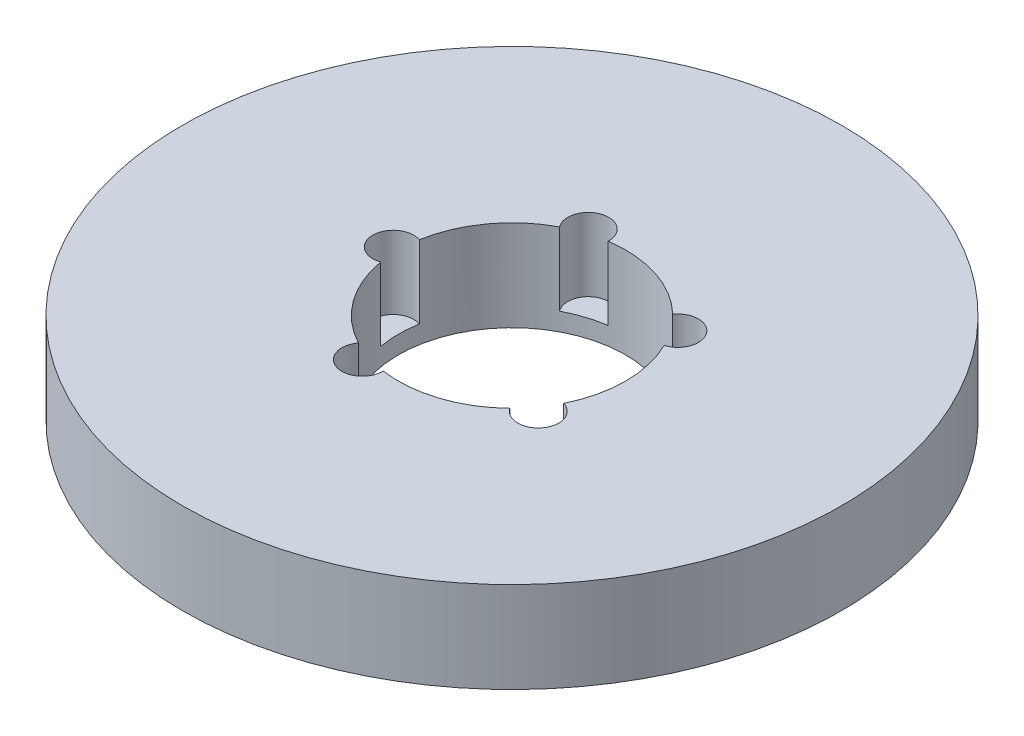
ISO-10303-21;
HEADER;
FILE_DESCRIPTION(('STEP AP214'),'2;1');
FILE_NAME('part.step','',(''),(''),'','','');
FILE_SCHEMA(('AUTOMOTIVE_DESIGN { 1 0 10303 214 1 1 1 1 }'));
ENDSEC;
DATA;
#1=APPLICATION_CONTEXT('core data for automotive mechanical design processes');
#2=APPLICATION_PROTOCOL_DEFINITION('international standard','automotive_design',2000,#1);
#3=PRODUCT_CONTEXT('',#1,'mechanical');
#4=PRODUCT('Part','Part','',(#3));
#5=PRODUCT_RELATED_PRODUCT_CATEGORY('part','',(#4));
#6=PRODUCT_DEFINITION_FORMATION('','',#4);
#7=PRODUCT_DEFINITION_CONTEXT('part definition',#1,'design');
#8=PRODUCT_DEFINITION('design','',#6,#7);
#9=PRODUCT_DEFINITION_SHAPE('','',#8);
#10=(LENGTH_UNIT() NAMED_UNIT(*) SI_UNIT(.MILLI.,.METRE.));
#11=(NAMED_UNIT(*) PLANE_ANGLE_UNIT() SI_UNIT($,.RADIAN.));
#12=(NAMED_UNIT(*) SI_UNIT($,.STERADIAN.) SOLID_ANGLE_UNIT());
#13=UNCERTAINTY_MEASURE_WITH_UNIT(LENGTH_MEASURE(1.E-05),#10,'distance_accuracy_value','');
#14=(GEOMETRIC_REPRESENTATION_CONTEXT(3) GLOBAL_UNCERTAINTY_ASSIGNED_CONTEXT((#13)) GLOBAL_UNIT_ASSIGNED_CONTEXT((#10,
#11,#12)) REPRESENTATION_CONTEXT('',''));
#15=CARTESIAN_POINT('',(0.,0.,0.));
#16=DIRECTION('',(0.,0.,1.));
#17=DIRECTION('',(1.,0.,0.));
#18=AXIS2_PLACEMENT_3D('',#15,#16,#17);
#19=CARTESIAN_POINT('',(0.,20.,0.));
#20=DIRECTION('',(0.,-1.,0.));
#21=DIRECTION('',(0.,0.,-1.));
#22=AXIS2_PLACEMENT_3D('',#19,#20,#21);
#23=CYLINDRICAL_SURFACE('',#22,72.5);
#24=CARTESIAN_POINT('',(0.,20.,0.));
#25=DIRECTION('',(0.,1.,0.));
#26=DIRECTION('',(0.,0.,1.));
#27=AXIS2_PLACEMENT_3D('',#24,#25,#26);
#28=CIRCLE('',#27,72.5);
#29=CARTESIAN_POINT('',(0.,20.,72.5));
#30=VERTEX_POINT('',#29);
#31=EDGE_CURVE('E160',#30,#30,#28,.T.);
#32=ORIENTED_EDGE('',*,*,#31,.F.);
#33=EDGE_LOOP('',(#32));
#34=FACE_BOUND('',#33,.T.);
#35=CARTESIAN_POINT('',(0.,0.,0.));
#36=DIRECTION('',(0.,1.,0.));
#37=DIRECTION('',(0.,0.,1.));
#38=AXIS2_PLACEMENT_3D('',#35,#36,#37);
#39=CIRCLE('',#38,72.5);
#40=CARTESIAN_POINT('',(0.,0.,72.5));
#41=VERTEX_POINT('',#40);
#42=EDGE_CURVE('E153',#41,#41,#39,.T.);
#43=ORIENTED_EDGE('',*,*,#42,.T.);
#44=EDGE_LOOP('',(#43));
#45=FACE_BOUND('',#44,.T.);
#46=ADVANCED_FACE('F39',(#34,#45),#23,.T.);
#47=CARTESIAN_POINT('',(0.,20.,0.));
#48=DIRECTION('',(0.,1.,0.));
#49=DIRECTION('',(0.,0.,1.));
#50=AXIS2_PLACEMENT_3D('',#47,#48,#49);
#51=PLANE('',#50);
#52=CARTESIAN_POINT('',(-8.07488520360902,20.,24.8519412557278));
#53=DIRECTION('',(0.,1.,0.));
#54=DIRECTION('',(0.951056516295155,0.,0.309016994374945));
#55=AXIS2_PLACEMENT_3D('',#52,#53,#54);
#56=CIRCLE('',#55,4.50272773655138);
#57=CARTESIAN_POINT('',(-11.6527432233736,20.,22.1181729663668));
#58=VERTEX_POINT('',#57);
#59=CARTESIAN_POINT('',(-3.5734685784876,20.,24.7432884297654));
#60=VERTEX_POINT('',#59);
#61=EDGE_CURVE('E186',#58,#60,#56,.T.);
#62=ORIENTED_EDGE('',*,*,#61,.F.);
#63=CARTESIAN_POINT('',(0.,20.,0.));
#64=DIRECTION('',(0.,1.,0.));
#65=DIRECTION('',(0.,0.,1.));
#66=AXIS2_PLACEMENT_3D('',#63,#64,#65);
#67=CIRCLE('',#66,25.);
#68=CARTESIAN_POINT('',(-24.6365282153164,20.,4.24752604417183));
#69=VERTEX_POINT('',#68);
#70=EDGE_CURVE('E148',#69,#58,#67,.T.);
#71=ORIENTED_EDGE('',*,*,#70,.F.);
#72=CARTESIAN_POINT('',(-26.1308774293862,20.,0.));
#73=DIRECTION('',(0.,1.,0.));
#74=DIRECTION('',(0.,0.,1.));
#75=AXIS2_PLACEMENT_3D('',#72,#73,#74);
#76=CIRCLE('',#75,4.50272773655138);
#77=CARTESIAN_POINT('',(-24.6365282153164,20.,-4.24752604417183));
#78=VERTEX_POINT('',#77);
#79=EDGE_CURVE('E142',#78,#69,#76,.T.);
#80=ORIENTED_EDGE('',*,*,#79,.F.);
#81=CARTESIAN_POINT('',(-11.6527432233739,20.,-22.1181729663667));
#82=VERTEX_POINT('',#81);
#83=EDGE_CURVE('E132',#82,#78,#67,.T.);
#84=ORIENTED_EDGE('',*,*,#83,.F.);
#85=CARTESIAN_POINT('',(-8.07488520360937,20.,-24.8519412557276));
#86=DIRECTION('',(0.,1.,0.));
#87=DIRECTION('',(-0.95105651629515,0.,0.309016994374958));
#88=AXIS2_PLACEMENT_3D('',#85,#86,#87);
#89=CIRCLE('',#88,4.50272773655138);
#90=CARTESIAN_POINT('',(-3.57346857848795,20.,-24.7432884297653));
#91=VERTEX_POINT('',#90);
#92=EDGE_CURVE('E111',#91,#82,#89,.T.);
#93=ORIENTED_EDGE('',*,*,#92,.F.);
#94=CARTESIAN_POINT('',(17.4347368410963,20.,-17.9173087064358));
#95=VERTEX_POINT('',#94);
#96=EDGE_CURVE('E141',#95,#91,#67,.T.);
#97=ORIENTED_EDGE('',*,*,#96,.F.);
#98=CARTESIAN_POINT('',(21.1403239183021,20.,-15.3593443824557));
#99=DIRECTION('',(0.,1.,0.));
#100=DIRECTION('',(-0.58778525229248,0.,-0.809016994374942));
#101=AXIS2_PLACEMENT_3D('',#98,#99,#100);
#102=CIRCLE('',#101,4.50272773655138);
#103=CARTESIAN_POINT('',(22.4280031760812,20.,-11.0446671988654));
#104=VERTEX_POINT('',#103);
#105=EDGE_CURVE('E173',#104,#95,#102,.T.);
#106=ORIENTED_EDGE('',*,*,#105,.F.);
#107=CARTESIAN_POINT('',(22.4280031760813,20.,11.0446671988651));
#108=VERTEX_POINT('',#107);
#109=EDGE_CURVE('E150',#108,#104,#67,.T.);
#110=ORIENTED_EDGE('',*,*,#109,.F.);
#111=CARTESIAN_POINT('',(21.1403239183023,20.,15.3593443824554));
#112=DIRECTION('',(0.,1.,0.));
#113=DIRECTION('',(0.587785252292469,0.,-0.809016994374951));
#114=AXIS2_PLACEMENT_3D('',#111,#112,#113);
#115=CIRCLE('',#114,4.50272773655138);
#116=CARTESIAN_POINT('',(17.4347368410966,20.,17.9173087064355));
#117=VERTEX_POINT('',#116);
#118=EDGE_CURVE('E172',#117,#108,#115,.T.);
#119=ORIENTED_EDGE('',*,*,#118,.F.);
#120=EDGE_CURVE('E152',#60,#117,#67,.T.);
#121=ORIENTED_EDGE('',*,*,#120,.F.);
#122=EDGE_LOOP('',(#62,#71,#80,#84,#93,#97,#106,#110,#119,#121));
#123=FACE_BOUND('',#122,.T.);
#124=ORIENTED_EDGE('',*,*,#31,.T.);
#125=EDGE_LOOP('',(#124));
#126=FACE_BOUND('',#125,.T.);
#127=ADVANCED_FACE('F138',(#123,#126),#51,.T.);
#128=CARTESIAN_POINT('',(0.,0.,0.));
#129=DIRECTION('',(0.,1.,0.));
#130=DIRECTION('',(0.,0.,1.));
#131=AXIS2_PLACEMENT_3D('',#128,#129,#130);
#132=PLANE('',#131);
#133=CARTESIAN_POINT('',(0.,0.,0.));
#134=DIRECTION('',(0.,1.,0.));
#135=DIRECTION('',(0.,0.,1.));
#136=AXIS2_PLACEMENT_3D('',#133,#134,#135);
#137=CIRCLE('',#136,25.);
#138=CARTESIAN_POINT('',(0.,0.,25.));
#139=VERTEX_POINT('',#138);
#140=EDGE_CURVE('E145',#139,#139,#137,.T.);
#141=ORIENTED_EDGE('',*,*,#140,.T.);
#142=EDGE_LOOP('',(#141));
#143=FACE_BOUND('',#142,.T.);
#144=ORIENTED_EDGE('',*,*,#42,.F.);
#145=EDGE_LOOP('',(#144));
#146=FACE_BOUND('',#145,.T.);
#147=ADVANCED_FACE('F216',(#143,#146),#132,.F.);
#148=CARTESIAN_POINT('',(0.,20.,0.));
#149=DIRECTION('',(0.,-1.,0.));
#150=DIRECTION('',(0.,0.,-1.));
#151=AXIS2_PLACEMENT_3D('',#148,#149,#150);
#152=CYLINDRICAL_SURFACE('',#151,25.);
#153=DIRECTION('',(0.,1.,0.));
#154=VECTOR('',#153,1.);
#155=CARTESIAN_POINT('',(-11.6527432233736,11.9732657203015,22.1181729663668));
#156=LINE('',#155,#154);
#157=CARTESIAN_POINT('',(-11.6527432233736,3.94653144060295,22.1181729663668));
#158=VERTEX_POINT('',#157);
#159=EDGE_CURVE('E11',#158,#58,#156,.T.);
#160=ORIENTED_EDGE('',*,*,#159,.F.);
#161=CARTESIAN_POINT('',(0.,3.94653144060295,0.));
#162=DIRECTION('',(0.,1.,0.));
#163=DIRECTION('',(0.,0.,1.));
#164=AXIS2_PLACEMENT_3D('',#161,#162,#163);
#165=CIRCLE('',#164,25.);
#166=CARTESIAN_POINT('',(-3.5734685784876,3.94653144060295,24.7432884297654));
#167=VERTEX_POINT('',#166);
#168=EDGE_CURVE('E192',#158,#167,#165,.T.);
#169=ORIENTED_EDGE('',*,*,#168,.T.);
#170=DIRECTION('',(0.,1.,0.));
#171=VECTOR('',#170,1.);
#172=CARTESIAN_POINT('',(-3.5734685784876,11.9732657203015,24.7432884297654));
#173=LINE('',#172,#171);
#174=EDGE_CURVE('E46',#60,#167,#173,.F.);
#175=ORIENTED_EDGE('',*,*,#174,.F.);
#176=ORIENTED_EDGE('',*,*,#120,.T.);
#177=DIRECTION('',(0.,1.,0.));
#178=VECTOR('',#177,1.);
#179=CARTESIAN_POINT('',(17.4347368410966,11.9732657203015,17.9173087064355));
#180=LINE('',#179,#178);
#181=CARTESIAN_POINT('',(17.4347368410966,3.94653144060295,17.9173087064355));
#182=VERTEX_POINT('',#181);
#183=EDGE_CURVE('E195',#182,#117,#180,.T.);
#184=ORIENTED_EDGE('',*,*,#183,.F.);
#185=CARTESIAN_POINT('',(0.,3.94653144060295,0.));
#186=DIRECTION('',(0.,1.,0.));
#187=DIRECTION('',(0.,0.,1.));
#188=AXIS2_PLACEMENT_3D('',#185,#186,#187);
#189=CIRCLE('',#188,25.);
#190=CARTESIAN_POINT('',(22.4280031760813,3.94653144060295,11.0446671988651));
#191=VERTEX_POINT('',#190);
#192=EDGE_CURVE('E197',#182,#191,#189,.T.);
#193=ORIENTED_EDGE('',*,*,#192,.T.);
#194=DIRECTION('',(0.,1.,0.));
#195=VECTOR('',#194,1.);
#196=CARTESIAN_POINT('',(22.4280031760813,11.9732657203015,11.0446671988651));
#197=LINE('',#196,#195);
#198=EDGE_CURVE('E168',#108,#191,#197,.F.);
#199=ORIENTED_EDGE('',*,*,#198,.F.);
#200=ORIENTED_EDGE('',*,*,#109,.T.);
#201=DIRECTION('',(0.,1.,0.));
#202=VECTOR('',#201,1.);
#203=CARTESIAN_POINT('',(22.4280031760812,11.9732657203015,-11.0446671988654));
#204=LINE('',#203,#202);
#205=CARTESIAN_POINT('',(22.4280031760812,3.94653144060295,-11.0446671988654));
#206=VERTEX_POINT('',#205);
#207=EDGE_CURVE('E169',#206,#104,#204,.T.);
#208=ORIENTED_EDGE('',*,*,#207,.F.);
#209=CARTESIAN_POINT('',(0.,3.94653144060295,0.));
#210=DIRECTION('',(0.,1.,0.));
#211=DIRECTION('',(0.,0.,1.));
#212=AXIS2_PLACEMENT_3D('',#209,#210,#211);
#213=CIRCLE('',#212,25.);
#214=CARTESIAN_POINT('',(17.4347368410963,3.94653144060295,-17.9173087064358));
#215=VERTEX_POINT('',#214);
#216=EDGE_CURVE('E332',#206,#215,#213,.T.);
#217=ORIENTED_EDGE('',*,*,#216,.T.);
#218=DIRECTION('',(0.,1.,0.));
#219=VECTOR('',#218,1.);
#220=CARTESIAN_POINT('',(17.4347368410963,11.9732657203015,-17.9173087064358));
#221=LINE('',#220,#219);
#222=EDGE_CURVE('E335',#95,#215,#221,.F.);
#223=ORIENTED_EDGE('',*,*,#222,.F.);
#224=ORIENTED_EDGE('',*,*,#96,.T.);
#225=DIRECTION('',(0.,1.,0.));
#226=VECTOR('',#225,1.);
#227=CARTESIAN_POINT('',(-3.57346857848795,11.9732657203015,-24.7432884297653));
#228=LINE('',#227,#226);
#229=CARTESIAN_POINT('',(-3.57346857848795,3.94653144060295,-24.7432884297653));
#230=VERTEX_POINT('',#229);
#231=EDGE_CURVE('E121',#230,#91,#228,.T.);
#232=ORIENTED_EDGE('',*,*,#231,.F.);
#233=CARTESIAN_POINT('',(0.,3.94653144060295,0.));
#234=DIRECTION('',(0.,1.,0.));
#235=DIRECTION('',(0.,0.,1.));
#236=AXIS2_PLACEMENT_3D('',#233,#234,#235);
#237=CIRCLE('',#236,25.);
#238=CARTESIAN_POINT('',(-11.6527432233739,3.94653144060295,-22.1181729663667));
#239=VERTEX_POINT('',#238);
#240=EDGE_CURVE('E134',#230,#239,#237,.T.);
#241=ORIENTED_EDGE('',*,*,#240,.T.);
#242=DIRECTION('',(0.,1.,0.));
#243=VECTOR('',#242,1.);
#244=CARTESIAN_POINT('',(-11.6527432233739,11.9732657203015,-22.1181729663667));
#245=LINE('',#244,#243);
#246=EDGE_CURVE('E117',#82,#239,#245,.F.);
#247=ORIENTED_EDGE('',*,*,#246,.F.);
#248=ORIENTED_EDGE('',*,*,#83,.T.);
#249=DIRECTION('',(0.,1.,0.));
#250=VECTOR('',#249,1.);
#251=CARTESIAN_POINT('',(-24.6365282153164,11.9732657203015,-4.24752604417184));
#252=LINE('',#251,#250);
#253=CARTESIAN_POINT('',(-24.6365282153164,3.94653144060295,-4.24752604417183));
#254=VERTEX_POINT('',#253);
#255=EDGE_CURVE('E338',#254,#78,#252,.T.);
#256=ORIENTED_EDGE('',*,*,#255,.F.);
#257=CARTESIAN_POINT('',(0.,3.94653144060295,0.));
#258=DIRECTION('',(0.,1.,0.));
#259=DIRECTION('',(0.,0.,1.));
#260=AXIS2_PLACEMENT_3D('',#257,#258,#259);
#261=CIRCLE('',#260,25.);
#262=CARTESIAN_POINT('',(-24.6365282153164,3.94653144060295,4.24752604417183));
#263=VERTEX_POINT('',#262);
#264=EDGE_CURVE('E342',#254,#263,#261,.T.);
#265=ORIENTED_EDGE('',*,*,#264,.T.);
#266=DIRECTION('',(0.,1.,0.));
#267=VECTOR('',#266,1.);
#268=CARTESIAN_POINT('',(-24.6365282153164,11.9732657203015,4.24752604417184));
#269=LINE('',#268,#267);
#270=EDGE_CURVE('E341',#69,#263,#269,.F.);
#271=ORIENTED_EDGE('',*,*,#270,.F.);
#272=ORIENTED_EDGE('',*,*,#70,.T.);
#273=EDGE_LOOP('',(#160,#169,#175,#176,#184,#193,#199,#200,#208,#217,#223,#224,#232,#241,#247,
#248,#256,#265,#271,#272));
#274=FACE_BOUND('',#273,.T.);
#275=ORIENTED_EDGE('',*,*,#140,.F.);
#276=EDGE_LOOP('',(#275));
#277=FACE_BOUND('',#276,.T.);
#278=ADVANCED_FACE('F128',(#274,#277),#152,.F.);
#279=CARTESIAN_POINT('',(-26.1308774293862,3.94653144060295,0.));
#280=DIRECTION('',(0.,1.,0.));
#281=DIRECTION('',(0.,0.,1.));
#282=AXIS2_PLACEMENT_3D('',#279,#280,#281);
#283=CYLINDRICAL_SURFACE('',#282,4.50272773655138);
#284=ORIENTED_EDGE('',*,*,#255,.T.);
#285=ORIENTED_EDGE('',*,*,#79,.T.);
#286=ORIENTED_EDGE('',*,*,#270,.T.);
#287=CARTESIAN_POINT('',(-26.1308774293862,3.94653144060295,0.));
#288=DIRECTION('',(0.,1.,0.));
#289=DIRECTION('',(0.,0.,1.));
#290=AXIS2_PLACEMENT_3D('',#287,#288,#289);
#291=CIRCLE('',#290,4.50272773655138);
#292=EDGE_CURVE('E149',#254,#263,#291,.T.);
#293=ORIENTED_EDGE('',*,*,#292,.F.);
#294=EDGE_LOOP('',(#284,#285,#286,#293));
#295=FACE_BOUND('',#294,.T.);
#296=ADVANCED_FACE('F227',(#295),#283,.F.);
#297=CARTESIAN_POINT('',(-26.1308774293862,3.94653144060295,0.));
#298=DIRECTION('',(0.,1.,0.));
#299=DIRECTION('',(0.,0.,1.));
#300=AXIS2_PLACEMENT_3D('',#297,#298,#299);
#301=PLANE('',#300);
#302=ORIENTED_EDGE('',*,*,#292,.T.);
#303=ORIENTED_EDGE('',*,*,#264,.F.);
#304=EDGE_LOOP('',(#302,#303));
#305=FACE_BOUND('',#304,.T.);
#306=ADVANCED_FACE('F235',(#305),#301,.T.);
#307=CARTESIAN_POINT('',(-8.07488520360937,3.94653144060295,-24.8519412557276));
#308=DIRECTION('',(0.,1.,0.));
#309=DIRECTION('',(0.,0.,1.));
#310=AXIS2_PLACEMENT_3D('',#307,#308,#309);
#311=CYLINDRICAL_SURFACE('',#310,4.50272773655138);
#312=ORIENTED_EDGE('',*,*,#231,.T.);
#313=ORIENTED_EDGE('',*,*,#92,.T.);
#314=ORIENTED_EDGE('',*,*,#246,.T.);
#315=CARTESIAN_POINT('',(-8.07488520360937,3.94653144060295,-24.8519412557276));
#316=DIRECTION('',(0.,1.,0.));
#317=DIRECTION('',(-0.95105651629515,0.,0.309016994374958));
#318=AXIS2_PLACEMENT_3D('',#315,#316,#317);
#319=CIRCLE('',#318,4.50272773655138);
#320=EDGE_CURVE('E127',#230,#239,#319,.T.);
#321=ORIENTED_EDGE('',*,*,#320,.F.);
#322=EDGE_LOOP('',(#312,#313,#314,#321));
#323=FACE_BOUND('',#322,.T.);
#324=ADVANCED_FACE('F116',(#323),#311,.F.);
#325=CARTESIAN_POINT('',(-8.07488520360937,3.94653144060295,-24.8519412557276));
#326=DIRECTION('',(0.,1.,0.));
#327=DIRECTION('',(-0.95105651629515,0.,0.309016994374958));
#328=AXIS2_PLACEMENT_3D('',#325,#326,#327);
#329=PLANE('',#328);
#330=ORIENTED_EDGE('',*,*,#320,.T.);
#331=ORIENTED_EDGE('',*,*,#240,.F.);
#332=EDGE_LOOP('',(#330,#331));
#333=FACE_BOUND('',#332,.T.);
#334=ADVANCED_FACE('F236',(#333),#329,.T.);
#335=CARTESIAN_POINT('',(21.1403239183021,3.94653144060295,-15.3593443824557));
#336=DIRECTION('',(0.,1.,0.));
#337=DIRECTION('',(0.,0.,1.));
#338=AXIS2_PLACEMENT_3D('',#335,#336,#337);
#339=CYLINDRICAL_SURFACE('',#338,4.50272773655138);
#340=ORIENTED_EDGE('',*,*,#207,.T.);
#341=ORIENTED_EDGE('',*,*,#105,.T.);
#342=ORIENTED_EDGE('',*,*,#222,.T.);
#343=CARTESIAN_POINT('',(21.1403239183021,3.94653144060295,-15.3593443824557));
#344=DIRECTION('',(0.,1.,0.));
#345=DIRECTION('',(-0.58778525229248,0.,-0.809016994374942));
#346=AXIS2_PLACEMENT_3D('',#343,#344,#345);
#347=CIRCLE('',#346,4.50272773655138);
#348=EDGE_CURVE('E177',#206,#215,#347,.T.);
#349=ORIENTED_EDGE('',*,*,#348,.F.);
#350=EDGE_LOOP('',(#340,#341,#342,#349));
#351=FACE_BOUND('',#350,.T.);
#352=ADVANCED_FACE('F241',(#351),#339,.F.);
#353=CARTESIAN_POINT('',(21.1403239183021,3.94653144060295,-15.3593443824557));
#354=DIRECTION('',(0.,1.,0.));
#355=DIRECTION('',(-0.58778525229248,0.,-0.809016994374942));
#356=AXIS2_PLACEMENT_3D('',#353,#354,#355);
#357=PLANE('',#356);
#358=ORIENTED_EDGE('',*,*,#348,.T.);
#359=ORIENTED_EDGE('',*,*,#216,.F.);
#360=EDGE_LOOP('',(#358,#359));
#361=FACE_BOUND('',#360,.T.);
#362=ADVANCED_FACE('F244',(#361),#357,.T.);
#363=CARTESIAN_POINT('',(21.1403239183023,3.94653144060295,15.3593443824554));
#364=DIRECTION('',(0.,1.,0.));
#365=DIRECTION('',(0.,0.,1.));
#366=AXIS2_PLACEMENT_3D('',#363,#364,#365);
#367=CYLINDRICAL_SURFACE('',#366,4.50272773655138);
#368=ORIENTED_EDGE('',*,*,#183,.T.);
#369=ORIENTED_EDGE('',*,*,#118,.T.);
#370=ORIENTED_EDGE('',*,*,#198,.T.);
#371=CARTESIAN_POINT('',(21.1403239183023,3.94653144060295,15.3593443824554));
#372=DIRECTION('',(0.,1.,0.));
#373=DIRECTION('',(0.587785252292469,0.,-0.809016994374951));
#374=AXIS2_PLACEMENT_3D('',#371,#372,#373);
#375=CIRCLE('',#374,4.50272773655138);
#376=EDGE_CURVE('E56',#182,#191,#375,.T.);
#377=ORIENTED_EDGE('',*,*,#376,.F.);
#378=EDGE_LOOP('',(#368,#369,#370,#377));
#379=FACE_BOUND('',#378,.T.);
#380=ADVANCED_FACE('F191',(#379),#367,.F.);
#381=CARTESIAN_POINT('',(21.1403239183023,3.94653144060295,15.3593443824554));
#382=DIRECTION('',(0.,1.,0.));
#383=DIRECTION('',(0.587785252292469,0.,-0.809016994374951));
#384=AXIS2_PLACEMENT_3D('',#381,#382,#383);
#385=PLANE('',#384);
#386=ORIENTED_EDGE('',*,*,#376,.T.);
#387=ORIENTED_EDGE('',*,*,#192,.F.);
#388=EDGE_LOOP('',(#386,#387));
#389=FACE_BOUND('',#388,.T.);
#390=ADVANCED_FACE('F208',(#389),#385,.T.);
#391=CARTESIAN_POINT('',(-8.07488520360902,3.94653144060295,24.8519412557278));
#392=DIRECTION('',(0.,1.,0.));
#393=DIRECTION('',(0.,0.,1.));
#394=AXIS2_PLACEMENT_3D('',#391,#392,#393);
#395=CYLINDRICAL_SURFACE('',#394,4.50272773655138);
#396=ORIENTED_EDGE('',*,*,#159,.T.);
#397=ORIENTED_EDGE('',*,*,#61,.T.);
#398=ORIENTED_EDGE('',*,*,#174,.T.);
#399=CARTESIAN_POINT('',(-8.07488520360902,3.94653144060295,24.8519412557278));
#400=DIRECTION('',(0.,1.,0.));
#401=DIRECTION('',(0.951056516295155,0.,0.309016994374945));
#402=AXIS2_PLACEMENT_3D('',#399,#400,#401);
#403=CIRCLE('',#402,4.50272773655138);
#404=EDGE_CURVE('E55',#158,#167,#403,.T.);
#405=ORIENTED_EDGE('',*,*,#404,.F.);
#406=EDGE_LOOP('',(#396,#397,#398,#405));
#407=FACE_BOUND('',#406,.T.);
#408=ADVANCED_FACE('F203',(#407),#395,.F.);
#409=CARTESIAN_POINT('',(-8.07488520360902,3.94653144060295,24.8519412557278));
#410=DIRECTION('',(0.,1.,0.));
#411=DIRECTION('',(0.951056516295155,0.,0.309016994374945));
#412=AXIS2_PLACEMENT_3D('',#409,#410,#411);
#413=PLANE('',#412);
#414=ORIENTED_EDGE('',*,*,#404,.T.);
#415=ORIENTED_EDGE('',*,*,#168,.F.);
#416=EDGE_LOOP('',(#414,#415));
#417=FACE_BOUND('',#416,.T.);
#418=ADVANCED_FACE('F205',(#417),#413,.T.);
#419=CLOSED_SHELL('',(#46,#127,#147,#278,#296,#306,#324,#334,#352,#362,#380,#390,#408,#418));
#420=MANIFOLD_SOLID_BREP('B2',#419);
#421=ADVANCED_BREP_SHAPE_REPRESENTATION('',(#18,#420),#14);
#422=SHAPE_DEFINITION_REPRESENTATION(#9,#421);
ENDSEC;
END-ISO-10303-21;
